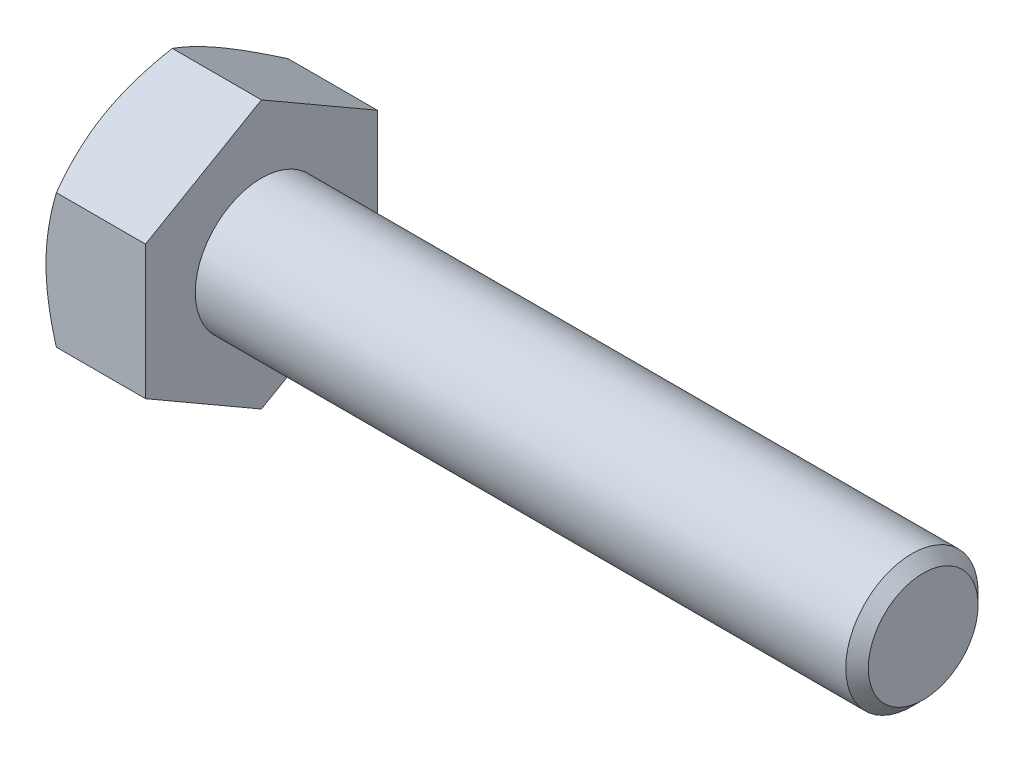
ISO-10303-21;
HEADER;
FILE_DESCRIPTION(('STEP AP214'),'2;1');
FILE_NAME('part.step','',(''),(''),'','','');
FILE_SCHEMA(('AUTOMOTIVE_DESIGN { 1 0 10303 214 1 1 1 1 }'));
ENDSEC;
DATA;
#1=APPLICATION_CONTEXT('core data for automotive mechanical design processes');
#2=APPLICATION_PROTOCOL_DEFINITION('international standard','automotive_design',2000,#1);
#3=PRODUCT_CONTEXT('',#1,'mechanical');
#4=PRODUCT('Part','Part','',(#3));
#5=PRODUCT_RELATED_PRODUCT_CATEGORY('part','',(#4));
#6=PRODUCT_DEFINITION_FORMATION('','',#4);
#7=PRODUCT_DEFINITION_CONTEXT('part definition',#1,'design');
#8=PRODUCT_DEFINITION('design','',#6,#7);
#9=PRODUCT_DEFINITION_SHAPE('','',#8);
#10=(LENGTH_UNIT() NAMED_UNIT(*) SI_UNIT(.MILLI.,.METRE.));
#11=(NAMED_UNIT(*) PLANE_ANGLE_UNIT() SI_UNIT($,.RADIAN.));
#12=(NAMED_UNIT(*) SI_UNIT($,.STERADIAN.) SOLID_ANGLE_UNIT());
#13=UNCERTAINTY_MEASURE_WITH_UNIT(LENGTH_MEASURE(1.E-05),#10,'distance_accuracy_value','');
#14=(GEOMETRIC_REPRESENTATION_CONTEXT(3) GLOBAL_UNCERTAINTY_ASSIGNED_CONTEXT((#13)) GLOBAL_UNIT_ASSIGNED_CONTEXT((#10,
#11,#12)) REPRESENTATION_CONTEXT('',''));
#15=CARTESIAN_POINT('',(0.,0.,0.));
#16=DIRECTION('',(0.,0.,1.));
#17=DIRECTION('',(1.,0.,0.));
#18=AXIS2_PLACEMENT_3D('',#15,#16,#17);
#19=CARTESIAN_POINT('',(4.7752,3.21156860739421,-5.5626));
#20=DIRECTION('',(0.,-0.866025403784438,0.500000000000001));
#21=DIRECTION('',(0.,-0.500000000000001,-0.866025403784438));
#22=AXIS2_PLACEMENT_3D('',#19,#20,#21);
#23=PLANE('',#22);
#24=CARTESIAN_POINT('',(0.496898061070143,6.42325268484227,0.0002));
#25=CARTESIAN_POINT('',(0.45614620225513,6.35265858120791,-0.122072574209491));
#26=CARTESIAN_POINT('',(0.417243775308723,6.2818012683745,-0.244801040124762));
#27=CARTESIAN_POINT('',(0.343647161560542,6.13951120287093,-0.491254662989243));
#28=CARTESIAN_POINT('',(0.308954790139044,6.06807821602765,-0.614980225538197));
#29=CARTESIAN_POINT('',(0.211873701066855,5.85263550648139,-0.98813794459262));
#30=CARTESIAN_POINT('',(0.156654841923373,5.70777535201369,-1.23904309212296));
#31=CARTESIAN_POINT('',(0.0919037861815275,5.49099476252075,-1.61451808721946));
#32=CARTESIAN_POINT('',(0.0734579983429333,5.41972205873199,-1.7379660313744));
#33=CARTESIAN_POINT('',(0.0425268916674615,5.27685459691414,-1.98541973399132));
#34=CARTESIAN_POINT('',(0.030041046189008,5.20525986790488,-2.10942544218948));
#35=CARTESIAN_POINT('',(0.0113480299394708,5.06194605565757,-2.35765224642821));
#36=CARTESIAN_POINT('',(0.00513373340584708,4.9902272065059,-2.48187293701928));
#37=CARTESIAN_POINT('',(-0.000889599359095551,4.84672720555795,-2.7304222295473));
#38=CARTESIAN_POINT('',(-0.000698833448296274,4.7749460557547,-2.85475082803225));
#39=CARTESIAN_POINT('',(0.00862810136342285,4.57828637012706,-3.19537539533985));
#40=CARTESIAN_POINT('',(0.0242873955350757,4.4534722013835,-3.41155987710816));
#41=CARTESIAN_POINT('',(0.0739443233816052,4.20467287416474,-3.84249295274001));
#42=CARTESIAN_POINT('',(0.107958931423458,4.08068859075412,-4.05724003094723));
#43=CARTESIAN_POINT('',(0.192986041409677,3.83138850679899,-4.4890404426887));
#44=CARTESIAN_POINT('',(0.244358813937401,3.70610416511176,-4.70603928788379));
#45=CARTESIAN_POINT('',(0.360954456999593,3.45740388365365,-5.13680081122592));
#46=CARTESIAN_POINT('',(0.426149937617058,3.33398475856357,-5.35056900650764));
#47=CARTESIAN_POINT('',(0.496898061070137,3.21145313734037,-5.5628));
#48=B_SPLINE_CURVE_WITH_KNOTS('',3,(#24,#25,#26,#27,#28,#29,#30,#31,#32,#33,#34,#35,#36,#37,#38,
#39,#40,#41,#42,#43,#44,#45,#46,#47),.UNSPECIFIED.,.F.,.F.,(4,2,2,2,2,2,2,2,2,2,2,4),(0.,
0.44082011856227,0.8818296488474,1.76568130465017,2.19678242164486,2.62784543796583,
3.05841812523868,3.48897751176353,4.23854798324166,4.98881282275669,5.75571809391027,
6.52111769989992),.UNSPECIFIED.);
#49=CARTESIAN_POINT('',(0.496831392605788,6.42313721478843,0.));
#50=VERTEX_POINT('',#49);
#51=CARTESIAN_POINT('',(0.,4.81735291109131,-2.78130000000001));
#52=VERTEX_POINT('',#51);
#53=EDGE_CURVE('E52',#50,#52,#48,.T.);
#54=ORIENTED_EDGE('',*,*,#53,.F.);
#55=DIRECTION('',(-1.,0.,0.));
#56=VECTOR('',#55,1.);
#57=CARTESIAN_POINT('',(4.7752,6.42313721478843,0.));
#58=LINE('',#57,#56);
#59=CARTESIAN_POINT('',(4.7752,6.42313721478843,0.));
#60=VERTEX_POINT('',#59);
#61=EDGE_CURVE('E148',#60,#50,#58,.T.);
#62=ORIENTED_EDGE('',*,*,#61,.F.);
#63=DIRECTION('',(0.,0.500000000000001,0.866025403784438));
#64=VECTOR('',#63,1.);
#65=CARTESIAN_POINT('',(4.7752,3.21156860739421,-5.5626));
#66=LINE('',#65,#64);
#67=CARTESIAN_POINT('',(4.7752,3.21156860739421,-5.5626));
#68=VERTEX_POINT('',#67);
#69=EDGE_CURVE('E239',#68,#60,#66,.T.);
#70=ORIENTED_EDGE('',*,*,#69,.F.);
#71=DIRECTION('',(-1.,0.,0.));
#72=VECTOR('',#71,1.);
#73=CARTESIAN_POINT('',(4.7752,3.21156860739421,-5.5626));
#74=LINE('',#73,#72);
#75=CARTESIAN_POINT('',(0.496831392605783,3.21156860739421,-5.5626));
#76=VERTEX_POINT('',#75);
#77=EDGE_CURVE('E136',#68,#76,#74,.T.);
#78=ORIENTED_EDGE('',*,*,#77,.T.);
#79=EDGE_CURVE('E130',#52,#76,#48,.T.);
#80=ORIENTED_EDGE('',*,*,#79,.F.);
#81=EDGE_LOOP('',(#54,#62,#70,#78,#80));
#82=FACE_BOUND('',#81,.T.);
#83=ADVANCED_FACE('F36',(#82),#23,.F.);
#84=CARTESIAN_POINT('',(4.7752,6.42313721478843,0.));
#85=DIRECTION('',(0.,-0.866025403784438,-0.500000000000001));
#86=DIRECTION('',(0.,0.500000000000001,-0.866025403784438));
#87=AXIS2_PLACEMENT_3D('',#84,#85,#86);
#88=PLANE('',#87);
#89=CARTESIAN_POINT('',(0.496898061070137,3.21145313734037,5.5628));
#90=CARTESIAN_POINT('',(0.456146202255125,3.28204724097473,5.44052742579051));
#91=CARTESIAN_POINT('',(0.417243775308718,3.35290455380814,5.31779895987524));
#92=CARTESIAN_POINT('',(0.343647161560538,3.49519461931171,5.07134533701076));
#93=CARTESIAN_POINT('',(0.30895479013904,3.56662760615498,4.9476197744618));
#94=CARTESIAN_POINT('',(0.211873701066851,3.78207031570124,4.57446205540738));
#95=CARTESIAN_POINT('',(0.15665484192337,3.92693047016895,4.32355690787704));
#96=CARTESIAN_POINT('',(0.0919037861815256,4.14371105966188,3.94808191278055));
#97=CARTESIAN_POINT('',(0.0734579983429316,4.21498376345064,3.82463396862561));
#98=CARTESIAN_POINT('',(0.0425268916674604,4.35785122526849,3.57718026600868));
#99=CARTESIAN_POINT('',(0.0300410461890073,4.42944595427775,3.45317455781052));
#100=CARTESIAN_POINT('',(0.0113480299394703,4.57275976652506,3.20494775357179));
#101=CARTESIAN_POINT('',(0.00513373340584622,4.64447861567673,3.08072706298073));
#102=CARTESIAN_POINT('',(-0.000889599359096195,4.78797861662468,2.8321777704527));
#103=CARTESIAN_POINT('',(-0.000698833448296402,4.85975976642794,2.70784917196775));
#104=CARTESIAN_POINT('',(0.00862810136342377,5.05641945205558,2.36722460466016));
#105=CARTESIAN_POINT('',(0.0242873955350769,5.18123362079913,2.15104012289184));
#106=CARTESIAN_POINT('',(0.0739443233816068,5.4300329480179,1.72010704725999));
#107=CARTESIAN_POINT('',(0.10795893142346,5.55401723142852,1.50535996905278));
#108=CARTESIAN_POINT('',(0.192986041409679,5.80331731538365,1.0735595573113));
#109=CARTESIAN_POINT('',(0.244358813937404,5.92860165707088,0.856560712116214));
#110=CARTESIAN_POINT('',(0.360954456999597,6.17730193852899,0.425799188774084));
#111=CARTESIAN_POINT('',(0.426149937617063,6.30072106361907,0.212030993492363));
#112=CARTESIAN_POINT('',(0.496898061070142,6.42325268484227,-0.000199999999999788));
#113=B_SPLINE_CURVE_WITH_KNOTS('',3,(#89,#90,#91,#92,#93,#94,#95,#96,#97,#98,#99,#100,#101,#102,
#103,#104,#105,#106,#107,#108,#109,#110,#111,#112),.UNSPECIFIED.,.F.,.F.,(4,2,2,2,2,2,2,2,2,2,2,
4),(0.,0.440820118562269,0.881829648847399,1.76568130465016,2.19678242164486,2.62784543796583,
3.05841812523867,3.48897751176352,4.23854798324166,4.98881282275669,5.75571809391027,
6.52111769989992),.UNSPECIFIED.);
#114=CARTESIAN_POINT('',(0.496831392605783,3.21156860739421,5.5626));
#115=VERTEX_POINT('',#114);
#116=CARTESIAN_POINT('',(0.,4.81735291109131,2.78130000000001));
#117=VERTEX_POINT('',#116);
#118=EDGE_CURVE('E59',#115,#117,#113,.T.);
#119=ORIENTED_EDGE('',*,*,#118,.F.);
#120=DIRECTION('',(-1.,0.,0.));
#121=VECTOR('',#120,1.);
#122=CARTESIAN_POINT('',(4.7752,3.21156860739421,5.5626));
#123=LINE('',#122,#121);
#124=CARTESIAN_POINT('',(4.7752,3.21156860739421,5.5626));
#125=VERTEX_POINT('',#124);
#126=EDGE_CURVE('E146',#125,#115,#123,.T.);
#127=ORIENTED_EDGE('',*,*,#126,.F.);
#128=DIRECTION('',(0.,-0.500000000000001,0.866025403784438));
#129=VECTOR('',#128,1.);
#130=CARTESIAN_POINT('',(4.7752,6.42313721478843,0.));
#131=LINE('',#130,#129);
#132=EDGE_CURVE('E237',#60,#125,#131,.T.);
#133=ORIENTED_EDGE('',*,*,#132,.F.);
#134=ORIENTED_EDGE('',*,*,#61,.T.);
#135=EDGE_CURVE('E163',#117,#50,#113,.T.);
#136=ORIENTED_EDGE('',*,*,#135,.F.);
#137=EDGE_LOOP('',(#119,#127,#133,#134,#136));
#138=FACE_BOUND('',#137,.T.);
#139=ADVANCED_FACE('F169',(#138),#88,.F.);
#140=CARTESIAN_POINT('',(4.7752,3.21156860739421,5.5626));
#141=DIRECTION('',(0.,0.,-1.));
#142=DIRECTION('',(0.,1.,0.));
#143=AXIS2_PLACEMENT_3D('',#140,#141,#142);
#144=PLANE('',#143);
#145=CARTESIAN_POINT('',(2.76946298118782,-8.73931907134927,5.5626));
#146=CARTESIAN_POINT('',(2.65067477687312,-8.49536496294497,5.5626));
#147=CARTESIAN_POINT('',(2.53299354297043,-8.25086273134793,5.5626));
#148=CARTESIAN_POINT('',(2.30046552320844,-7.76047089715342,5.5626));
#149=CARTESIAN_POINT('',(2.18561916316987,-7.5145810928649,5.5626));
#150=CARTESIAN_POINT('',(1.95882765602869,-7.01990967591009,5.5626));
#151=CARTESIAN_POINT('',(1.8469007539214,-6.77111967039447,5.5626));
#152=CARTESIAN_POINT('',(1.62748022369642,-6.27159952720681,5.5626));
#153=CARTESIAN_POINT('',(1.51998639326666,-6.02086947869408,5.5626));
#154=CARTESIAN_POINT('',(1.30708686305049,-5.50862062515996,5.5626));
#155=CARTESIAN_POINT('',(1.2018721345633,-5.24702202730585,5.5626));
#156=CARTESIAN_POINT('',(0.999136458565241,-4.72080610690396,5.5626));
#157=CARTESIAN_POINT('',(0.901616358276675,-4.45618845560252,5.5626));
#158=CARTESIAN_POINT('',(0.716747076854941,-3.92397402586808,5.5626));
#159=CARTESIAN_POINT('',(0.629378259627778,-3.65638413416905,5.5626));
#160=CARTESIAN_POINT('',(0.467540995367504,-3.11736467394693,5.5626));
#161=CARTESIAN_POINT('',(0.393068603844486,-2.84593630702824,5.5626));
#162=CARTESIAN_POINT('',(0.260913640576689,-2.3005952403753,5.5626));
#163=CARTESIAN_POINT('',(0.203137923933971,-2.0267054719603,5.5626));
#164=CARTESIAN_POINT('',(0.107584140993963,-1.47536640605574,5.5626));
#165=CARTESIAN_POINT('',(0.0698039298235418,-1.19791749361909,5.5626));
#166=CARTESIAN_POINT('',(0.0306329033129838,-0.782024037078659,5.5626));
#167=CARTESIAN_POINT('',(0.0205033244370692,-0.644369603517906,5.5626));
#168=CARTESIAN_POINT('',(0.00607539249484276,-0.368760084714105,5.5626));
#169=CARTESIAN_POINT('',(0.001776487806837,-0.23080502914899,5.5626));
#170=CARTESIAN_POINT('',(-0.000882415988902745,0.0451740110860421,5.5626));
#171=CARTESIAN_POINT('',(0.000758104200529315,0.183198000728097,5.5626));
#172=CARTESIAN_POINT('',(0.00993570123351525,0.459040077970901,5.5626));
#173=CARTESIAN_POINT('',(0.0174725517322422,0.596858173271936,5.5626));
#174=CARTESIAN_POINT('',(0.0422505226941692,0.924672766545142,5.5626));
#175=CARTESIAN_POINT('',(0.0620998981240959,1.11447655015001,5.5626));
#176=CARTESIAN_POINT('',(0.11192524345136,1.49274005777642,5.5626));
#177=CARTESIAN_POINT('',(0.141902492996071,1.68119960888145,5.5626));
#178=CARTESIAN_POINT('',(0.245441794558734,2.24430469004824,5.5626));
#179=CARTESIAN_POINT('',(0.332595181454098,2.61648783903803,5.5626));
#180=CARTESIAN_POINT('',(0.484580656688797,3.17327423069248,5.5626));
#181=CARTESIAN_POINT('',(0.539535147458609,3.36074033845108,5.5626));
#182=CARTESIAN_POINT('',(0.655361856953687,3.73385345225386,5.5626));
#183=CARTESIAN_POINT('',(0.716234120687404,3.91950044445068,5.5626));
#184=CARTESIAN_POINT('',(0.842902268347432,4.28903173945151,5.5626));
#185=CARTESIAN_POINT('',(0.908696733188394,4.47291653318726,5.5626));
#186=CARTESIAN_POINT('',(1.04441413237549,4.83914664715103,5.5626));
#187=CARTESIAN_POINT('',(1.11433697604312,5.02149200109188,5.5626));
#188=CARTESIAN_POINT('',(1.30616254116173,5.50788799936829,5.5626));
#189=CARTESIAN_POINT('',(1.43118964217263,5.81070521732176,5.5626));
#190=CARTESIAN_POINT('',(1.68847909791363,6.41326146392027,5.5626));
#191=CARTESIAN_POINT('',(1.82074222334613,6.71300016062079,5.5626));
#192=CARTESIAN_POINT('',(2.09080854329268,7.31009692856944,5.5626));
#193=CARTESIAN_POINT('',(2.22861377416229,7.60745407573434,5.5626));
#194=CARTESIAN_POINT('',(2.50845292532567,8.20015103027085,5.5626));
#195=CARTESIAN_POINT('',(2.65048668069894,8.4954909157686,5.5626));
#196=CARTESIAN_POINT('',(2.93809441051761,9.08501121024942,5.5626));
#197=CARTESIAN_POINT('',(3.08367358024025,9.37918907947536,5.5626));
#198=CARTESIAN_POINT('',(3.3774807874048,9.96621951539326,5.5626));
#199=CARTESIAN_POINT('',(3.52570884593012,10.2590720715133,5.5626));
#200=CARTESIAN_POINT('',(3.97349977739061,11.135883002068,5.5626));
#201=CARTESIAN_POINT('',(4.27623214013078,11.7182219913802,5.5626));
#202=CARTESIAN_POINT('',(4.85550678061973,12.8193647778852,5.5626));
#203=CARTESIAN_POINT('',(5.131489866857,13.3384641726992,5.5626));
#204=CARTESIAN_POINT('',(5.68680572725548,14.3749069841369,5.5626));
#205=CARTESIAN_POINT('',(5.96613869990832,14.8922502943533,5.5626));
#206=CARTESIAN_POINT('',(6.52636532569116,15.9238879354022,5.5626));
#207=CARTESIAN_POINT('',(6.80725082971984,16.438186698545,5.5626));
#208=CARTESIAN_POINT('',(7.37092859091902,17.465687215985,5.5626));
#209=CARTESIAN_POINT('',(7.65372069975336,17.9788890516247,5.5626));
#210=CARTESIAN_POINT('',(7.93720779447483,18.4917042756102,5.5626));
#211=B_SPLINE_CURVE_WITH_KNOTS('',3,(#145,#146,#147,#148,#149,#150,#151,#152,#153,#154,#155,
#156,#157,#158,#159,#160,#161,#162,#163,#164,#165,#166,#167,#168,#169,#170,#171,#172,#173,#174,
#175,#176,#177,#178,#179,#180,#181,#182,#183,#184,#185,#186,#187,#188,#189,#190,#191,#192,#193,
#194,#195,#196,#197,#198,#199,#200,#201,#202,#203,#204,#205,#206,#207,#208,#209,#210),
.UNSPECIFIED.,.F.,.F.,(4,2,2,2,2,2,2,2,2,2,2,2,2,2,2,2,2,2,2,2,2,2,2,2,2,2,2,2,2,2,2,2,4),(0.,
0.814023059457574,1.62816765666496,2.44655638570204,3.26490772451191,4.1107076400708,
4.95660055342857,5.80082897227975,6.64479871831149,7.4839651145243,8.32304147698215,
8.73701667946677,9.15095271433074,9.56492494141958,9.97888127796806,10.5510771655991,
11.1233453766966,12.2684477407956,12.8544603586944,13.4404774339429,14.0263262050101,
14.6121621128824,15.5948602729038,16.577663303757,17.5608308091096,18.5439600191606,
19.52862868616,20.5133051939663,22.4822323595086,24.2459312012703,26.0097350693917,
27.7677407284946,29.5256111556825),.UNSPECIFIED.);
#212=CARTESIAN_POINT('',(0.496831392605779,-3.21156860739419,5.5626));
#213=VERTEX_POINT('',#212);
#214=CARTESIAN_POINT('',(0.,0.,5.5626));
#215=VERTEX_POINT('',#214);
#216=EDGE_CURVE('E249',#213,#215,#211,.T.);
#217=ORIENTED_EDGE('',*,*,#216,.F.);
#218=DIRECTION('',(-1.,0.,0.));
#219=VECTOR('',#218,1.);
#220=CARTESIAN_POINT('',(4.7752,-3.21156860739419,5.5626));
#221=LINE('',#220,#219);
#222=CARTESIAN_POINT('',(4.7752,-3.21156860739419,5.5626));
#223=VERTEX_POINT('',#222);
#224=EDGE_CURVE('E138',#223,#213,#221,.T.);
#225=ORIENTED_EDGE('',*,*,#224,.F.);
#226=DIRECTION('',(0.,-1.,0.));
#227=VECTOR('',#226,1.);
#228=CARTESIAN_POINT('',(4.7752,3.21156860739421,5.5626));
#229=LINE('',#228,#227);
#230=EDGE_CURVE('E233',#125,#223,#229,.T.);
#231=ORIENTED_EDGE('',*,*,#230,.F.);
#232=ORIENTED_EDGE('',*,*,#126,.T.);
#233=EDGE_CURVE('E187',#215,#115,#211,.T.);
#234=ORIENTED_EDGE('',*,*,#233,.F.);
#235=EDGE_LOOP('',(#217,#225,#231,#232,#234));
#236=FACE_BOUND('',#235,.T.);
#237=ADVANCED_FACE('F255',(#236),#144,.F.);
#238=CARTESIAN_POINT('',(4.7752,-6.42313721478842,0.));
#239=DIRECTION('',(0.,0.866025403784438,-0.500000000000002));
#240=DIRECTION('',(0.,0.500000000000002,0.866025403784438));
#241=AXIS2_PLACEMENT_3D('',#238,#239,#240);
#242=PLANE('',#241);
#243=CARTESIAN_POINT('',(0.496898061070138,-6.42325268484226,-0.000200000000000038));
#244=CARTESIAN_POINT('',(0.456146202255126,-6.3526585812079,0.122072574209491));
#245=CARTESIAN_POINT('',(0.417243775308719,-6.28180126837449,0.244801040124762));
#246=CARTESIAN_POINT('',(0.343647161560538,-6.13951120287092,0.491254662989243));
#247=CARTESIAN_POINT('',(0.30895479013904,-6.06807821602765,0.614980225538197));
#248=CARTESIAN_POINT('',(0.21187370106685,-5.85263550648139,0.988137944592619));
#249=CARTESIAN_POINT('',(0.156654841923369,-5.70777535201368,1.23904309212296));
#250=CARTESIAN_POINT('',(0.0919037861815231,-5.49099476252075,1.61451808721945));
#251=CARTESIAN_POINT('',(0.0734579983429287,-5.41972205873199,1.73796603137439));
#252=CARTESIAN_POINT('',(0.0425268916674567,-5.27685459691413,1.98541973399132));
#253=CARTESIAN_POINT('',(0.0300410461890033,-5.20525986790488,2.10942544218948));
#254=CARTESIAN_POINT('',(0.0113480299394658,-5.06194605565756,2.35765224642821));
#255=CARTESIAN_POINT('',(0.00513373340584158,-4.99022720650589,2.48187293701927));
#256=CARTESIAN_POINT('',(-0.00088959935910106,-4.84672720555795,2.73042222954729));
#257=CARTESIAN_POINT('',(-0.000698833448301401,-4.77494605575469,2.85475082803225));
#258=CARTESIAN_POINT('',(0.00862810136341809,-4.57828637012705,3.19537539533984));
#259=CARTESIAN_POINT('',(0.0242873955350705,-4.45347220138349,3.41155987710816));
#260=CARTESIAN_POINT('',(0.0739443233815994,-4.20467287416473,3.84249295274001));
#261=CARTESIAN_POINT('',(0.107958931423452,-4.08068859075411,4.05724003094722));
#262=CARTESIAN_POINT('',(0.192986041409671,-3.83138850679897,4.48904044268869));
#263=CARTESIAN_POINT('',(0.244358813937396,-3.70610416511175,4.70603928788379));
#264=CARTESIAN_POINT('',(0.360954456999589,-3.45740388365364,5.13680081122591));
#265=CARTESIAN_POINT('',(0.426149937617054,-3.33398475856356,5.35056900650764));
#266=CARTESIAN_POINT('',(0.496898061070133,-3.21145313734036,5.5628));
#267=B_SPLINE_CURVE_WITH_KNOTS('',3,(#243,#244,#245,#246,#247,#248,#249,#250,#251,#252,#253,
#254,#255,#256,#257,#258,#259,#260,#261,#262,#263,#264,#265,#266),.UNSPECIFIED.,.F.,.F.,(4,2,2,
2,2,2,2,2,2,2,2,4),(0.,0.44082011856227,0.881829648847399,1.76568130465016,2.19678242164486,
2.62784543796583,3.05841812523868,3.48897751176352,4.23854798324166,4.98881282275669,
5.75571809391028,6.52111769989993),.UNSPECIFIED.);
#268=CARTESIAN_POINT('',(0.496831392605783,-6.42313721478842,0.));
#269=VERTEX_POINT('',#268);
#270=CARTESIAN_POINT('',(0.,-4.81735291109131,2.78130000000001));
#271=VERTEX_POINT('',#270);
#272=EDGE_CURVE('E171',#269,#271,#267,.T.);
#273=ORIENTED_EDGE('',*,*,#272,.F.);
#274=DIRECTION('',(-1.,0.,0.));
#275=VECTOR('',#274,1.);
#276=CARTESIAN_POINT('',(4.7752,-6.42313721478842,0.));
#277=LINE('',#276,#275);
#278=CARTESIAN_POINT('',(4.7752,-6.42313721478842,0.));
#279=VERTEX_POINT('',#278);
#280=EDGE_CURVE('E135',#279,#269,#277,.T.);
#281=ORIENTED_EDGE('',*,*,#280,.F.);
#282=DIRECTION('',(0.,-0.500000000000002,-0.866025403784438));
#283=VECTOR('',#282,1.);
#284=CARTESIAN_POINT('',(4.7752,-6.42313721478842,0.));
#285=LINE('',#284,#283);
#286=EDGE_CURVE('E231',#223,#279,#285,.T.);
#287=ORIENTED_EDGE('',*,*,#286,.F.);
#288=ORIENTED_EDGE('',*,*,#224,.T.);
#289=EDGE_CURVE('E173',#271,#213,#267,.T.);
#290=ORIENTED_EDGE('',*,*,#289,.F.);
#291=EDGE_LOOP('',(#273,#281,#287,#288,#290));
#292=FACE_BOUND('',#291,.T.);
#293=ADVANCED_FACE('F227',(#292),#242,.F.);
#294=CARTESIAN_POINT('',(4.7752,-3.21156860739422,-5.5626));
#295=DIRECTION('',(0.,0.866025403784439,0.499999999999999));
#296=DIRECTION('',(0.,-0.499999999999999,0.866025403784439));
#297=AXIS2_PLACEMENT_3D('',#294,#295,#296);
#298=PLANE('',#297);
#299=CARTESIAN_POINT('',(0.49689806107014,-3.21145313734038,-5.5628));
#300=CARTESIAN_POINT('',(0.456146202255128,-3.28204724097474,-5.44052742579051));
#301=CARTESIAN_POINT('',(0.417243775308721,-3.35290455380815,-5.31779895987524));
#302=CARTESIAN_POINT('',(0.343647161560541,-3.49519461931171,-5.07134533701076));
#303=CARTESIAN_POINT('',(0.308954790139042,-3.56662760615499,-4.9476197744618));
#304=CARTESIAN_POINT('',(0.211873701066853,-3.78207031570125,-4.57446205540738));
#305=CARTESIAN_POINT('',(0.156654841923372,-3.92693047016895,-4.32355690787704));
#306=CARTESIAN_POINT('',(0.0919037861815272,-4.14371105966189,-3.94808191278054));
#307=CARTESIAN_POINT('',(0.0734579983429331,-4.21498376345065,-3.8246339686256));
#308=CARTESIAN_POINT('',(0.0425268916674613,-4.3578512252685,-3.57718026600868));
#309=CARTESIAN_POINT('',(0.0300410461890077,-4.42944595427776,-3.45317455781052));
#310=CARTESIAN_POINT('',(0.0113480299394704,-4.57275976652507,-3.20494775357179));
#311=CARTESIAN_POINT('',(0.00513373340584659,-4.64447861567674,-3.08072706298072));
#312=CARTESIAN_POINT('',(-0.000889599359095559,-4.78797861662469,-2.8321777704527));
#313=CARTESIAN_POINT('',(-0.000698833448295763,-4.85975976642794,-2.70784917196775));
#314=CARTESIAN_POINT('',(0.00862810136342402,-5.05641945205558,-2.36722460466015));
#315=CARTESIAN_POINT('',(0.0242873955350764,-5.18123362079914,-2.15104012289184));
#316=CARTESIAN_POINT('',(0.0739443233816055,-5.4300329480179,-1.72010704725999));
#317=CARTESIAN_POINT('',(0.107958931423458,-5.55401723142852,-1.50535996905277));
#318=CARTESIAN_POINT('',(0.192986041409677,-5.80331731538365,-1.0735595573113));
#319=CARTESIAN_POINT('',(0.244358813937401,-5.92860165707087,-0.856560712116213));
#320=CARTESIAN_POINT('',(0.360954456999593,-6.17730193852898,-0.425799188774084));
#321=CARTESIAN_POINT('',(0.426149937617058,-6.30072106361906,-0.212030993492364));
#322=CARTESIAN_POINT('',(0.496898061070137,-6.42325268484226,0.000199999999999785));
#323=B_SPLINE_CURVE_WITH_KNOTS('',3,(#299,#300,#301,#302,#303,#304,#305,#306,#307,#308,#309,
#310,#311,#312,#313,#314,#315,#316,#317,#318,#319,#320,#321,#322),.UNSPECIFIED.,.F.,.F.,(4,2,2,
2,2,2,2,2,2,2,2,4),(0.,0.44082011856227,0.881829648847399,1.76568130465016,2.19678242164486,
2.62784543796583,3.05841812523868,3.48897751176353,4.23854798324166,4.98881282275669,
5.75571809391027,6.52111769989992),.UNSPECIFIED.);
#324=CARTESIAN_POINT('',(0.496831392605577,-3.21156860739453,-5.5626));
#325=VERTEX_POINT('',#324);
#326=CARTESIAN_POINT('',(0.,-4.81735291109132,-2.7813));
#327=VERTEX_POINT('',#326);
#328=EDGE_CURVE('E112',#325,#327,#323,.T.);
#329=ORIENTED_EDGE('',*,*,#328,.F.);
#330=DIRECTION('',(-1.,0.,0.));
#331=VECTOR('',#330,1.);
#332=CARTESIAN_POINT('',(4.7752,-3.21156860739422,-5.5626));
#333=LINE('',#332,#331);
#334=CARTESIAN_POINT('',(4.7752,-3.21156860739422,-5.5626));
#335=VERTEX_POINT('',#334);
#336=EDGE_CURVE('E126',#335,#325,#333,.T.);
#337=ORIENTED_EDGE('',*,*,#336,.F.);
#338=DIRECTION('',(0.,0.499999999999999,-0.866025403784439));
#339=VECTOR('',#338,1.);
#340=CARTESIAN_POINT('',(4.7752,-3.21156860739422,-5.5626));
#341=LINE('',#340,#339);
#342=EDGE_CURVE('E229',#279,#335,#341,.T.);
#343=ORIENTED_EDGE('',*,*,#342,.F.);
#344=ORIENTED_EDGE('',*,*,#280,.T.);
#345=EDGE_CURVE('E129',#327,#269,#323,.T.);
#346=ORIENTED_EDGE('',*,*,#345,.F.);
#347=EDGE_LOOP('',(#329,#337,#343,#344,#346));
#348=FACE_BOUND('',#347,.T.);
#349=ADVANCED_FACE('F124',(#348),#298,.F.);
#350=CARTESIAN_POINT('',(4.7752,3.21156860739421,-5.5626));
#351=DIRECTION('',(0.,0.,1.));
#352=DIRECTION('',(0.,-1.,0.));
#353=AXIS2_PLACEMENT_3D('',#350,#351,#352);
#354=PLANE('',#353);
#355=CARTESIAN_POINT('',(2.76946298300579,-8.73931907508182,-5.5626));
#356=CARTESIAN_POINT('',(2.65067477861528,-8.49536496655187,-5.5626));
#357=CARTESIAN_POINT('',(2.53299354463683,-8.25086273482909,-5.5626));
#358=CARTESIAN_POINT('',(2.30046552472368,-7.76047090038273,-5.5626));
#359=CARTESIAN_POINT('',(2.18561916460973,-7.51458109596809,-5.5626));
#360=CARTESIAN_POINT('',(1.95882765731771,-7.01990967875913,-5.5626));
#361=CARTESIAN_POINT('',(1.846900755135,-6.77111967311548,-5.5626));
#362=CARTESIAN_POINT('',(1.62748022476042,-6.27159952967089,-5.5626));
#363=CARTESIAN_POINT('',(1.51998639425648,-6.02086948102925,-5.5626));
#364=CARTESIAN_POINT('',(1.30708686388975,-5.50862062722724,-5.5626));
#365=CARTESIAN_POINT('',(1.20187213532635,-5.24702202923406,-5.5626));
#366=CARTESIAN_POINT('',(0.999136459179921,-4.72080610855179,-5.5626));
#367=CARTESIAN_POINT('',(0.901616358819192,-4.45618845710904,-5.5626));
#368=CARTESIAN_POINT('',(0.716747077259989,-3.92397402708938,-5.5626));
#369=CARTESIAN_POINT('',(0.629378259967502,-3.65638413524644,-5.5626));
#370=CARTESIAN_POINT('',(0.467540995587167,-3.11736467473259,-5.5626));
#371=CARTESIAN_POINT('',(0.393068604009408,-2.84593630766609,-5.5626));
#372=CARTESIAN_POINT('',(0.260913640631061,-2.3005952406421,-5.5626));
#373=CARTESIAN_POINT('',(0.203137923936715,-2.02670547200286,-5.5626));
#374=CARTESIAN_POINT('',(0.107584140927261,-1.47536640564425,-5.5626));
#375=CARTESIAN_POINT('',(0.0698039297389959,-1.19791749297779,-5.5626));
#376=CARTESIAN_POINT('',(0.0306329032322217,-0.782024036094228,-5.5626));
#377=CARTESIAN_POINT('',(0.0205033243625259,-0.644369602420759,-5.5626));
#378=CARTESIAN_POINT('',(0.00607539244269882,-0.368760083391737,-5.5626));
#379=CARTESIAN_POINT('',(0.00177648777087202,-0.230805027714119,-5.5626));
#380=CARTESIAN_POINT('',(-0.000882415982738997,0.0451740127451205,-5.5626));
#381=CARTESIAN_POINT('',(0.000758104232646156,0.183198002498878,-5.5626));
#382=CARTESIAN_POINT('',(0.00993570132662356,0.459040079963614,-5.5626));
#383=CARTESIAN_POINT('',(0.0174725518603882,0.596858175374879,-5.5626));
#384=CARTESIAN_POINT('',(0.0422505229084564,0.924672768817529,-5.5626));
#385=CARTESIAN_POINT('',(0.0620998983879045,1.11447655248113,-5.5626));
#386=CARTESIAN_POINT('',(0.111925243816849,1.49274006022233,-5.5626));
#387=CARTESIAN_POINT('',(0.141902493413719,1.6811996113834,-5.5626));
#388=CARTESIAN_POINT('',(0.245441795133936,2.24430469271526,-5.5626));
#389=CARTESIAN_POINT('',(0.332595182135701,2.61648784181073,-5.5626));
#390=CARTESIAN_POINT('',(0.484580657527369,3.17327423362326,-5.5626));
#391=CARTESIAN_POINT('',(0.539535148349865,3.36074034143568,-5.5626));
#392=CARTESIAN_POINT('',(0.655361857948679,3.7338534553455,-5.5626));
#393=CARTESIAN_POINT('',(0.716234121733449,3.91950044759555,-5.5626));
#394=CARTESIAN_POINT('',(0.842902269493736,4.28903174270241,-5.5626));
#395=CARTESIAN_POINT('',(0.908696734383899,4.47291653649097,-5.5626));
#396=CARTESIAN_POINT('',(1.04441413366767,4.83914665056038,-5.5626));
#397=CARTESIAN_POINT('',(1.11433697738277,5.02149200455406,-5.5626));
#398=CARTESIAN_POINT('',(1.30616254258248,5.5078880028608,-5.5626));
#399=CARTESIAN_POINT('',(1.43118964362202,5.81070522079329,-5.5626));
#400=CARTESIAN_POINT('',(1.68847909941208,6.41326146735254,-5.5626));
#401=CARTESIAN_POINT('',(1.82074222486501,6.71300016403479,-5.5626));
#402=CARTESIAN_POINT('',(2.09080854484644,7.31009693194881,-5.5626));
#403=CARTESIAN_POINT('',(2.22861377573049,7.60745407909738,-5.5626));
#404=CARTESIAN_POINT('',(2.50845292691854,8.20015103360298,-5.5626));
#405=CARTESIAN_POINT('',(2.65048668230202,8.49549091908616,-5.5626));
#406=CARTESIAN_POINT('',(2.93809441213761,9.08501121353829,-5.5626));
#407=CARTESIAN_POINT('',(3.08367358186692,9.37918908275011,-5.5626));
#408=CARTESIAN_POINT('',(3.37748078904248,9.96621951864084,-5.5626));
#409=CARTESIAN_POINT('',(3.52570884757214,10.2590720747478,-5.5626));
#410=CARTESIAN_POINT('',(3.97349977904316,11.1358830052649,-5.5626));
#411=CARTESIAN_POINT('',(4.27623214178691,11.7182219945536,-5.5626));
#412=CARTESIAN_POINT('',(4.8555067822888,12.8193647810355,-5.5626));
#413=CARTESIAN_POINT('',(5.13148986853601,13.3384641758492,-5.5626));
#414=CARTESIAN_POINT('',(5.68680572895232,14.3749069872875,-5.5626));
#415=CARTESIAN_POINT('',(5.96613870161306,14.8922502975047,-5.5626));
#416=CARTESIAN_POINT('',(6.52636532741208,15.9238879385591,-5.5626));
#417=CARTESIAN_POINT('',(6.80725083144907,16.4381867017065,-5.5626));
#418=CARTESIAN_POINT('',(7.37092859266394,17.4656872191565,-5.5626));
#419=CARTESIAN_POINT('',(7.65372070150567,17.9788890548015,-5.5626));
#420=CARTESIAN_POINT('',(7.93720779623422,18.4917042787924,-5.5626));
#421=B_SPLINE_CURVE_WITH_KNOTS('',3,(#355,#356,#357,#358,#359,#360,#361,#362,#363,#364,#365,
#366,#367,#368,#369,#370,#371,#372,#373,#374,#375,#376,#377,#378,#379,#380,#381,#382,#383,#384,
#385,#386,#387,#388,#389,#390,#391,#392,#393,#394,#395,#396,#397,#398,#399,#400,#401,#402,#403,
#404,#405,#406,#407,#408,#409,#410,#411,#412,#413,#414,#415,#416,#417,#418,#419,#420),
.UNSPECIFIED.,.F.,.F.,(4,2,2,2,2,2,2,2,2,2,2,2,2,2,2,2,2,2,2,2,2,2,2,2,2,2,2,2,2,2,2,2,4),(0.,
0.814023059896039,1.62816765754195,2.44655638702216,3.26490772627512,4.11070764230638,
4.95660055613668,5.80082897545884,6.6447987219612,7.48396511886283,8.32304148200849,
8.7370166848287,9.15095272002818,9.56492494745272,9.97888128433688,10.5510771721585,
11.1233453834466,12.2684477479276,12.8544603660259,13.4404774414739,14.0263262127401,
14.6121621208114,15.5948602808078,16.5776633116356,17.5608308169621,18.5439600269871,
19.5286286939574,20.5133052017346,22.4822323672198,24.245931208995,26.0097350771296,
27.7677407362569,29.5256111634693),.UNSPECIFIED.);
#422=CARTESIAN_POINT('',(0.,0.,-5.5626));
#423=VERTEX_POINT('',#422);
#424=EDGE_CURVE('E118',#76,#423,#421,.F.);
#425=ORIENTED_EDGE('',*,*,#424,.F.);
#426=ORIENTED_EDGE('',*,*,#77,.F.);
#427=DIRECTION('',(0.,1.,0.));
#428=VECTOR('',#427,1.);
#429=CARTESIAN_POINT('',(4.7752,3.21156860739421,-5.5626));
#430=LINE('',#429,#428);
#431=EDGE_CURVE('E134',#335,#68,#430,.T.);
#432=ORIENTED_EDGE('',*,*,#431,.F.);
#433=ORIENTED_EDGE('',*,*,#336,.T.);
#434=EDGE_CURVE('E109',#423,#325,#421,.F.);
#435=ORIENTED_EDGE('',*,*,#434,.F.);
#436=EDGE_LOOP('',(#425,#426,#432,#433,#435));
#437=FACE_BOUND('',#436,.T.);
#438=ADVANCED_FACE('F132',(#437),#354,.F.);
#439=CARTESIAN_POINT('',(4.7752,6.42313721478843,0.));
#440=DIRECTION('',(1.,0.,0.));
#441=DIRECTION('',(0.,0.,-1.));
#442=AXIS2_PLACEMENT_3D('',#439,#440,#441);
#443=PLANE('',#442);
#444=CARTESIAN_POINT('',(4.7752,0.,0.));
#445=DIRECTION('',(1.,0.,0.));
#446=DIRECTION('',(0.,0.,-1.));
#447=AXIS2_PLACEMENT_3D('',#444,#445,#446);
#448=CIRCLE('',#447,3.175);
#449=CARTESIAN_POINT('',(4.7752,0.,-3.175));
#450=VERTEX_POINT('',#449);
#451=EDGE_CURVE('E242',#450,#450,#448,.F.);
#452=ORIENTED_EDGE('',*,*,#451,.T.);
#453=EDGE_LOOP('',(#452));
#454=FACE_BOUND('',#453,.T.);
#455=ORIENTED_EDGE('',*,*,#69,.T.);
#456=ORIENTED_EDGE('',*,*,#132,.T.);
#457=ORIENTED_EDGE('',*,*,#230,.T.);
#458=ORIENTED_EDGE('',*,*,#286,.T.);
#459=ORIENTED_EDGE('',*,*,#342,.T.);
#460=ORIENTED_EDGE('',*,*,#431,.T.);
#461=EDGE_LOOP('',(#455,#456,#457,#458,#459,#460));
#462=FACE_BOUND('',#461,.T.);
#463=ADVANCED_FACE('F257',(#454,#462),#443,.T.);
#464=CARTESIAN_POINT('',(0.,0.,0.));
#465=DIRECTION('',(-1.,0.,0.));
#466=DIRECTION('',(0.,0.,1.));
#467=AXIS2_PLACEMENT_3D('',#464,#465,#466);
#468=CYLINDRICAL_SURFACE('',#467,3.175);
#469=ORIENTED_EDGE('',*,*,#451,.F.);
#470=EDGE_LOOP('',(#469));
#471=FACE_BOUND('',#470,.T.);
#472=CARTESIAN_POINT('',(35.98418,0.,0.));
#473=DIRECTION('',(-1.,0.,0.));
#474=DIRECTION('',(0.,0.,1.));
#475=AXIS2_PLACEMENT_3D('',#472,#473,#474);
#476=CIRCLE('',#475,3.175);
#477=CARTESIAN_POINT('',(35.98418,0.,3.175));
#478=VERTEX_POINT('',#477);
#479=EDGE_CURVE('E245',#478,#478,#476,.T.);
#480=ORIENTED_EDGE('',*,*,#479,.T.);
#481=EDGE_LOOP('',(#480));
#482=FACE_BOUND('',#481,.T.);
#483=ADVANCED_FACE('F288',(#471,#482),#468,.T.);
#484=CARTESIAN_POINT('',(36.5252,0.,0.));
#485=DIRECTION('',(-1.,0.,0.));
#486=DIRECTION('',(0.,0.,1.));
#487=AXIS2_PLACEMENT_3D('',#484,#485,#486);
#488=CONICAL_SURFACE('',#487,2.63398,0.785398163397439);
#489=ORIENTED_EDGE('',*,*,#479,.F.);
#490=EDGE_LOOP('',(#489));
#491=FACE_BOUND('',#490,.T.);
#492=CARTESIAN_POINT('',(36.5252,0.,0.));
#493=DIRECTION('',(-1.,0.,0.));
#494=DIRECTION('',(0.,0.,1.));
#495=AXIS2_PLACEMENT_3D('',#492,#493,#494);
#496=CIRCLE('',#495,2.63398);
#497=CARTESIAN_POINT('',(36.5252,0.,2.63398));
#498=VERTEX_POINT('',#497);
#499=EDGE_CURVE('E247',#498,#498,#496,.T.);
#500=ORIENTED_EDGE('',*,*,#499,.T.);
#501=EDGE_LOOP('',(#500));
#502=FACE_BOUND('',#501,.T.);
#503=ADVANCED_FACE('F291',(#491,#502),#488,.T.);
#504=CARTESIAN_POINT('',(36.5252,0.,0.));
#505=DIRECTION('',(-1.,0.,0.));
#506=DIRECTION('',(0.,0.,1.));
#507=AXIS2_PLACEMENT_3D('',#504,#505,#506);
#508=PLANE('',#507);
#509=ORIENTED_EDGE('',*,*,#499,.F.);
#510=EDGE_LOOP('',(#509));
#511=FACE_BOUND('',#510,.T.);
#512=ADVANCED_FACE('F201',(#511),#508,.F.);
#513=CARTESIAN_POINT('',(0.,0.,0.));
#514=DIRECTION('',(1.,0.,0.));
#515=DIRECTION('',(0.,0.,-1.));
#516=AXIS2_PLACEMENT_3D('',#513,#514,#515);
#517=CONICAL_SURFACE('',#516,5.5626,1.0471975511966);
#518=ORIENTED_EDGE('',*,*,#328,.T.);
#519=CARTESIAN_POINT('',(0.,0.,0.));
#520=DIRECTION('',(1.,0.,0.));
#521=DIRECTION('',(0.,0.,-1.));
#522=AXIS2_PLACEMENT_3D('',#519,#520,#521);
#523=CIRCLE('',#522,5.5626);
#524=EDGE_CURVE('E40',#327,#423,#523,.T.);
#525=ORIENTED_EDGE('',*,*,#524,.T.);
#526=ORIENTED_EDGE('',*,*,#434,.T.);
#527=EDGE_LOOP('',(#518,#525,#526));
#528=FACE_BOUND('',#527,.T.);
#529=ADVANCED_FACE('F111',(#528),#517,.T.);
#530=ORIENTED_EDGE('',*,*,#272,.T.);
#531=EDGE_CURVE('E153',#271,#327,#523,.T.);
#532=ORIENTED_EDGE('',*,*,#531,.T.);
#533=ORIENTED_EDGE('',*,*,#345,.T.);
#534=EDGE_LOOP('',(#530,#532,#533));
#535=FACE_BOUND('',#534,.T.);
#536=ADVANCED_FACE('F200',(#535),#517,.T.);
#537=ORIENTED_EDGE('',*,*,#216,.T.);
#538=EDGE_CURVE('E154',#215,#271,#523,.T.);
#539=ORIENTED_EDGE('',*,*,#538,.T.);
#540=ORIENTED_EDGE('',*,*,#289,.T.);
#541=EDGE_LOOP('',(#537,#539,#540));
#542=FACE_BOUND('',#541,.T.);
#543=ADVANCED_FACE('F195',(#542),#517,.T.);
#544=ORIENTED_EDGE('',*,*,#233,.T.);
#545=ORIENTED_EDGE('',*,*,#118,.T.);
#546=CARTESIAN_POINT('',(0.,0.,0.));
#547=DIRECTION('',(-1.,0.,0.));
#548=DIRECTION('',(0.,0.,1.));
#549=AXIS2_PLACEMENT_3D('',#546,#547,#548);
#550=CIRCLE('',#549,5.5626);
#551=EDGE_CURVE('E119',#215,#117,#550,.T.);
#552=ORIENTED_EDGE('',*,*,#551,.F.);
#553=EDGE_LOOP('',(#544,#545,#552));
#554=FACE_BOUND('',#553,.T.);
#555=ADVANCED_FACE('F199',(#554),#517,.T.);
#556=ORIENTED_EDGE('',*,*,#135,.T.);
#557=ORIENTED_EDGE('',*,*,#53,.T.);
#558=EDGE_CURVE('E45',#52,#117,#523,.T.);
#559=ORIENTED_EDGE('',*,*,#558,.T.);
#560=EDGE_LOOP('',(#556,#557,#559));
#561=FACE_BOUND('',#560,.T.);
#562=ADVANCED_FACE('F162',(#561),#517,.T.);
#563=ORIENTED_EDGE('',*,*,#79,.T.);
#564=ORIENTED_EDGE('',*,*,#424,.T.);
#565=EDGE_CURVE('E11',#423,#52,#523,.T.);
#566=ORIENTED_EDGE('',*,*,#565,.T.);
#567=EDGE_LOOP('',(#563,#564,#566));
#568=FACE_BOUND('',#567,.T.);
#569=ADVANCED_FACE('F260',(#568),#517,.T.);
#570=CARTESIAN_POINT('',(0.,6.42313721478843,0.));
#571=DIRECTION('',(1.,0.,0.));
#572=DIRECTION('',(0.,0.,-1.));
#573=AXIS2_PLACEMENT_3D('',#570,#571,#572);
#574=PLANE('',#573);
#575=ORIENTED_EDGE('',*,*,#565,.F.);
#576=ORIENTED_EDGE('',*,*,#524,.F.);
#577=ORIENTED_EDGE('',*,*,#531,.F.);
#578=ORIENTED_EDGE('',*,*,#538,.F.);
#579=ORIENTED_EDGE('',*,*,#551,.T.);
#580=ORIENTED_EDGE('',*,*,#558,.F.);
#581=EDGE_LOOP('',(#575,#576,#577,#578,#579,#580));
#582=FACE_BOUND('',#581,.T.);
#583=ADVANCED_FACE('F166',(#582),#574,.F.);
#584=CLOSED_SHELL('',(#83,#139,#237,#293,#349,#438,#463,#483,#503,#512,#529,#536,#543,#555,#562,
#569,#583));
#585=MANIFOLD_SOLID_BREP('B2',#584);
#586=ADVANCED_BREP_SHAPE_REPRESENTATION('',(#18,#585),#14);
#587=SHAPE_DEFINITION_REPRESENTATION(#9,#586);
ENDSEC;
END-ISO-10303-21;
